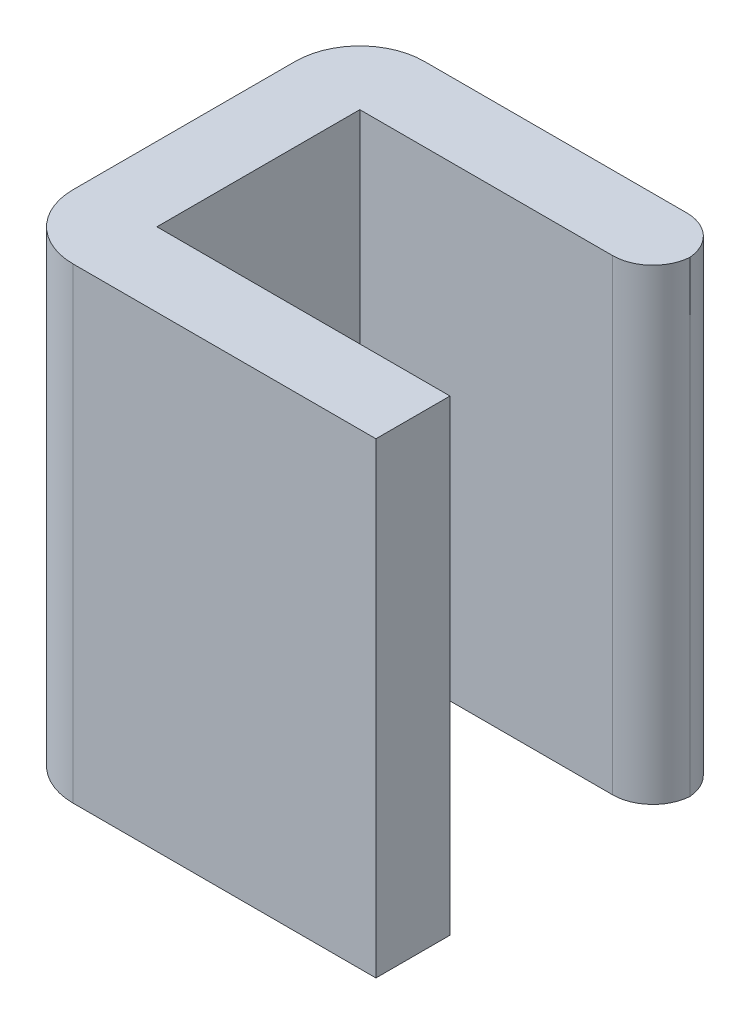
ISO-10303-21;
HEADER;
FILE_DESCRIPTION(('STEP AP214'),'2;1');
FILE_NAME('part.step','',(''),(''),'','','');
FILE_SCHEMA(('AUTOMOTIVE_DESIGN { 1 0 10303 214 1 1 1 1 }'));
ENDSEC;
DATA;
#1=APPLICATION_CONTEXT('core data for automotive mechanical design processes');
#2=APPLICATION_PROTOCOL_DEFINITION('international standard','automotive_design',2000,#1);
#3=PRODUCT_CONTEXT('',#1,'mechanical');
#4=PRODUCT('Part','Part','',(#3));
#5=PRODUCT_RELATED_PRODUCT_CATEGORY('part','',(#4));
#6=PRODUCT_DEFINITION_FORMATION('','',#4);
#7=PRODUCT_DEFINITION_CONTEXT('part definition',#1,'design');
#8=PRODUCT_DEFINITION('design','',#6,#7);
#9=PRODUCT_DEFINITION_SHAPE('','',#8);
#10=(LENGTH_UNIT() NAMED_UNIT(*) SI_UNIT(.MILLI.,.METRE.));
#11=(NAMED_UNIT(*) PLANE_ANGLE_UNIT() SI_UNIT($,.RADIAN.));
#12=(NAMED_UNIT(*) SI_UNIT($,.STERADIAN.) SOLID_ANGLE_UNIT());
#13=UNCERTAINTY_MEASURE_WITH_UNIT(LENGTH_MEASURE(1.E-05),#10,'distance_accuracy_value','');
#14=(GEOMETRIC_REPRESENTATION_CONTEXT(3) GLOBAL_UNCERTAINTY_ASSIGNED_CONTEXT((#13)) GLOBAL_UNIT_ASSIGNED_CONTEXT((#10,
#11,#12)) REPRESENTATION_CONTEXT('',''));
#15=CARTESIAN_POINT('',(0.,0.,0.));
#16=DIRECTION('',(0.,0.,1.));
#17=DIRECTION('',(1.,0.,0.));
#18=AXIS2_PLACEMENT_3D('',#15,#16,#17);
#19=CARTESIAN_POINT('',(-1.5825,-0.725,0.125));
#20=DIRECTION('',(0.,1.,0.));
#21=DIRECTION('',(0.,0.,1.));
#22=AXIS2_PLACEMENT_3D('',#19,#20,#21);
#23=CYLINDRICAL_SURFACE('',#22,0.125);
#24=CARTESIAN_POINT('',(-1.5825,-0.725,0.125));
#25=DIRECTION('',(0.,-1.,0.));
#26=DIRECTION('',(0.,0.,-1.));
#27=AXIS2_PLACEMENT_3D('',#24,#25,#26);
#28=CIRCLE('',#27,0.125);
#29=CARTESIAN_POINT('',(-1.5825,-0.725,0.));
#30=VERTEX_POINT('',#29);
#31=CARTESIAN_POINT('',(-1.45790064205623,-0.725,0.115));
#32=VERTEX_POINT('',#31);
#33=EDGE_CURVE('E203',#30,#32,#28,.T.);
#34=ORIENTED_EDGE('',*,*,#33,.F.);
#35=DIRECTION('',(0.,-1.,0.));
#36=VECTOR('',#35,1.);
#37=CARTESIAN_POINT('',(-1.5825,-0.725,0.));
#38=LINE('',#37,#36);
#39=CARTESIAN_POINT('',(-1.5825,0.725,0.));
#40=VERTEX_POINT('',#39);
#41=EDGE_CURVE('E21',#40,#30,#38,.T.);
#42=ORIENTED_EDGE('',*,*,#41,.F.);
#43=CARTESIAN_POINT('',(-1.5825,0.725,0.125));
#44=DIRECTION('',(0.,1.,0.));
#45=DIRECTION('',(0.,0.,-1.));
#46=AXIS2_PLACEMENT_3D('',#43,#44,#45);
#47=CIRCLE('',#46,0.125);
#48=CARTESIAN_POINT('',(-1.45790064205623,0.725,0.115));
#49=VERTEX_POINT('',#48);
#50=EDGE_CURVE('E182',#49,#40,#47,.T.);
#51=ORIENTED_EDGE('',*,*,#50,.F.);
#52=DIRECTION('',(0.,-1.,0.));
#53=VECTOR('',#52,1.);
#54=CARTESIAN_POINT('',(-1.45790064205623,0.,0.115));
#55=LINE('',#54,#53);
#56=EDGE_CURVE('E11',#49,#32,#55,.T.);
#57=ORIENTED_EDGE('',*,*,#56,.T.);
#58=EDGE_LOOP('',(#34,#42,#51,#57));
#59=FACE_BOUND('',#58,.T.);
#60=ADVANCED_FACE('F17',(#59),#23,.T.);
#61=CARTESIAN_POINT('',(-1.5825,-0.725,0.105));
#62=DIRECTION('',(0.,1.,0.));
#63=DIRECTION('',(0.,0.,1.));
#64=AXIS2_PLACEMENT_3D('',#61,#62,#63);
#65=CYLINDRICAL_SURFACE('',#64,0.125);
#66=DIRECTION('',(0.,1.,0.));
#67=VECTOR('',#66,1.);
#68=CARTESIAN_POINT('',(-1.5825,-0.725,0.23));
#69=LINE('',#68,#67);
#70=CARTESIAN_POINT('',(-1.5825,-0.725,0.23));
#71=VERTEX_POINT('',#70);
#72=CARTESIAN_POINT('',(-1.5825,0.725,0.23));
#73=VERTEX_POINT('',#72);
#74=EDGE_CURVE('E179',#71,#73,#69,.T.);
#75=ORIENTED_EDGE('',*,*,#74,.F.);
#76=CARTESIAN_POINT('',(-1.5825,-0.725,0.105));
#77=DIRECTION('',(0.,-1.,0.));
#78=DIRECTION('',(0.,0.,-1.));
#79=AXIS2_PLACEMENT_3D('',#76,#77,#78);
#80=CIRCLE('',#79,0.125);
#81=EDGE_CURVE('E200',#32,#71,#80,.T.);
#82=ORIENTED_EDGE('',*,*,#81,.F.);
#83=ORIENTED_EDGE('',*,*,#56,.F.);
#84=CARTESIAN_POINT('',(-1.5825,0.725,0.105));
#85=DIRECTION('',(0.,1.,0.));
#86=DIRECTION('',(0.,0.,-1.));
#87=AXIS2_PLACEMENT_3D('',#84,#85,#86);
#88=CIRCLE('',#87,0.125);
#89=EDGE_CURVE('E184',#73,#49,#88,.T.);
#90=ORIENTED_EDGE('',*,*,#89,.F.);
#91=EDGE_LOOP('',(#75,#82,#83,#90));
#92=FACE_BOUND('',#91,.T.);
#93=ADVANCED_FACE('F303',(#92),#65,.T.);
#94=CARTESIAN_POINT('',(-2.3975,-0.725,0.89));
#95=DIRECTION('',(0.,1.,0.));
#96=DIRECTION('',(0.,0.,1.));
#97=AXIS2_PLACEMENT_3D('',#94,#95,#96);
#98=CYLINDRICAL_SURFACE('',#97,0.2);
#99=CARTESIAN_POINT('',(-2.3975,-0.725,0.89));
#100=DIRECTION('',(0.,-1.,0.));
#101=DIRECTION('',(0.,0.,-1.));
#102=AXIS2_PLACEMENT_3D('',#99,#100,#101);
#103=CIRCLE('',#102,0.2);
#104=CARTESIAN_POINT('',(-2.3975,-0.725,1.09));
#105=VERTEX_POINT('',#104);
#106=CARTESIAN_POINT('',(-2.5975,-0.725,0.89));
#107=VERTEX_POINT('',#106);
#108=EDGE_CURVE('E112',#105,#107,#103,.T.);
#109=ORIENTED_EDGE('',*,*,#108,.F.);
#110=DIRECTION('',(0.,-1.,0.));
#111=VECTOR('',#110,1.);
#112=CARTESIAN_POINT('',(-2.3975,-0.725,1.09));
#113=LINE('',#112,#111);
#114=CARTESIAN_POINT('',(-2.3975,0.725,1.09));
#115=VERTEX_POINT('',#114);
#116=EDGE_CURVE('E143',#115,#105,#113,.T.);
#117=ORIENTED_EDGE('',*,*,#116,.F.);
#118=CARTESIAN_POINT('',(-2.3975,0.725,0.89));
#119=DIRECTION('',(0.,1.,0.));
#120=DIRECTION('',(0.,0.,-1.));
#121=AXIS2_PLACEMENT_3D('',#118,#119,#120);
#122=CIRCLE('',#121,0.2);
#123=CARTESIAN_POINT('',(-2.5975,0.725,0.89));
#124=VERTEX_POINT('',#123);
#125=EDGE_CURVE('E28',#124,#115,#122,.T.);
#126=ORIENTED_EDGE('',*,*,#125,.F.);
#127=DIRECTION('',(0.,1.,0.));
#128=VECTOR('',#127,1.);
#129=CARTESIAN_POINT('',(-2.5975,-0.725,0.89));
#130=LINE('',#129,#128);
#131=EDGE_CURVE('E247',#107,#124,#130,.T.);
#132=ORIENTED_EDGE('',*,*,#131,.F.);
#133=EDGE_LOOP('',(#109,#117,#126,#132));
#134=FACE_BOUND('',#133,.T.);
#135=ADVANCED_FACE('F301',(#134),#98,.T.);
#136=CARTESIAN_POINT('',(-2.3975,-0.725,0.2));
#137=DIRECTION('',(0.,1.,0.));
#138=DIRECTION('',(0.,0.,1.));
#139=AXIS2_PLACEMENT_3D('',#136,#137,#138);
#140=CYLINDRICAL_SURFACE('',#139,0.2);
#141=CARTESIAN_POINT('',(-2.3975,-0.725,0.2));
#142=DIRECTION('',(0.,-1.,0.));
#143=DIRECTION('',(0.,0.,-1.));
#144=AXIS2_PLACEMENT_3D('',#141,#142,#143);
#145=CIRCLE('',#144,0.2);
#146=CARTESIAN_POINT('',(-2.5975,-0.725,0.2));
#147=VERTEX_POINT('',#146);
#148=CARTESIAN_POINT('',(-2.3975,-0.725,0.));
#149=VERTEX_POINT('',#148);
#150=EDGE_CURVE('E189',#147,#149,#145,.T.);
#151=ORIENTED_EDGE('',*,*,#150,.F.);
#152=DIRECTION('',(0.,-1.,0.));
#153=VECTOR('',#152,1.);
#154=CARTESIAN_POINT('',(-2.5975,-0.725,0.2));
#155=LINE('',#154,#153);
#156=CARTESIAN_POINT('',(-2.5975,0.725,0.2));
#157=VERTEX_POINT('',#156);
#158=EDGE_CURVE('E170',#157,#147,#155,.T.);
#159=ORIENTED_EDGE('',*,*,#158,.F.);
#160=CARTESIAN_POINT('',(-2.3975,0.725,0.2));
#161=DIRECTION('',(0.,1.,0.));
#162=DIRECTION('',(0.,0.,-1.));
#163=AXIS2_PLACEMENT_3D('',#160,#161,#162);
#164=CIRCLE('',#163,0.2);
#165=CARTESIAN_POINT('',(-2.3975,0.725,0.));
#166=VERTEX_POINT('',#165);
#167=EDGE_CURVE('E103',#166,#157,#164,.T.);
#168=ORIENTED_EDGE('',*,*,#167,.F.);
#169=DIRECTION('',(0.,1.,0.));
#170=VECTOR('',#169,1.);
#171=CARTESIAN_POINT('',(-2.3975,-0.725,0.));
#172=LINE('',#171,#170);
#173=EDGE_CURVE('E252',#149,#166,#172,.T.);
#174=ORIENTED_EDGE('',*,*,#173,.F.);
#175=EDGE_LOOP('',(#151,#159,#168,#174));
#176=FACE_BOUND('',#175,.T.);
#177=ADVANCED_FACE('F297',(#176),#140,.T.);
#178=CARTESIAN_POINT('',(-2.0275,0.725,0.545));
#179=DIRECTION('',(0.,-1.,0.));
#180=DIRECTION('',(0.,0.,-1.));
#181=AXIS2_PLACEMENT_3D('',#178,#179,#180);
#182=PLANE('',#181);
#183=ORIENTED_EDGE('',*,*,#89,.T.);
#184=ORIENTED_EDGE('',*,*,#50,.T.);
#185=DIRECTION('',(-1.,0.,0.));
#186=VECTOR('',#185,1.);
#187=CARTESIAN_POINT('',(-2.0275,0.725,0.));
#188=LINE('',#187,#186);
#189=EDGE_CURVE('E259',#40,#166,#188,.T.);
#190=ORIENTED_EDGE('',*,*,#189,.T.);
#191=ORIENTED_EDGE('',*,*,#167,.T.);
#192=DIRECTION('',(0.,0.,1.));
#193=VECTOR('',#192,1.);
#194=CARTESIAN_POINT('',(-2.5975,0.725,0.545));
#195=LINE('',#194,#193);
#196=EDGE_CURVE('E174',#157,#124,#195,.T.);
#197=ORIENTED_EDGE('',*,*,#196,.T.);
#198=ORIENTED_EDGE('',*,*,#125,.T.);
#199=DIRECTION('',(1.,0.,0.));
#200=VECTOR('',#199,1.);
#201=CARTESIAN_POINT('',(-2.0275,0.725,1.09));
#202=LINE('',#201,#200);
#203=CARTESIAN_POINT('',(-1.4575,0.725,1.09));
#204=VERTEX_POINT('',#203);
#205=EDGE_CURVE('E133',#115,#204,#202,.T.);
#206=ORIENTED_EDGE('',*,*,#205,.T.);
#207=DIRECTION('',(0.,0.,-1.));
#208=VECTOR('',#207,1.);
#209=CARTESIAN_POINT('',(-1.4575,0.725,0.975));
#210=LINE('',#209,#208);
#211=CARTESIAN_POINT('',(-1.4575,0.725,0.86));
#212=VERTEX_POINT('',#211);
#213=EDGE_CURVE('E138',#204,#212,#210,.T.);
#214=ORIENTED_EDGE('',*,*,#213,.T.);
#215=DIRECTION('',(-1.,0.,0.));
#216=VECTOR('',#215,1.);
#217=CARTESIAN_POINT('',(-1.9125,0.725,0.86));
#218=LINE('',#217,#216);
#219=CARTESIAN_POINT('',(-2.3675,0.725,0.86));
#220=VERTEX_POINT('',#219);
#221=EDGE_CURVE('E216',#212,#220,#218,.T.);
#222=ORIENTED_EDGE('',*,*,#221,.T.);
#223=DIRECTION('',(0.,0.,-1.));
#224=VECTOR('',#223,1.);
#225=CARTESIAN_POINT('',(-2.3675,0.725,0.545));
#226=LINE('',#225,#224);
#227=CARTESIAN_POINT('',(-2.3675,0.725,0.23));
#228=VERTEX_POINT('',#227);
#229=EDGE_CURVE('E206',#220,#228,#226,.T.);
#230=ORIENTED_EDGE('',*,*,#229,.T.);
#231=DIRECTION('',(1.,0.,0.));
#232=VECTOR('',#231,1.);
#233=CARTESIAN_POINT('',(-1.9125,0.725,0.23));
#234=LINE('',#233,#232);
#235=EDGE_CURVE('E175',#228,#73,#234,.T.);
#236=ORIENTED_EDGE('',*,*,#235,.T.);
#237=EDGE_LOOP('',(#183,#184,#190,#191,#197,#198,#206,#214,#222,#230,#236));
#238=FACE_BOUND('',#237,.T.);
#239=ADVANCED_FACE('F136',(#238),#182,.F.);
#240=CARTESIAN_POINT('',(-2.0275,-0.725,0.545));
#241=DIRECTION('',(0.,-1.,0.));
#242=DIRECTION('',(0.,0.,-1.));
#243=AXIS2_PLACEMENT_3D('',#240,#241,#242);
#244=PLANE('',#243);
#245=DIRECTION('',(-1.,0.,0.));
#246=VECTOR('',#245,1.);
#247=CARTESIAN_POINT('',(-2.0275,-0.725,0.));
#248=LINE('',#247,#246);
#249=EDGE_CURVE('E168',#30,#149,#248,.T.);
#250=ORIENTED_EDGE('',*,*,#249,.F.);
#251=ORIENTED_EDGE('',*,*,#33,.T.);
#252=ORIENTED_EDGE('',*,*,#81,.T.);
#253=DIRECTION('',(1.,0.,0.));
#254=VECTOR('',#253,1.);
#255=CARTESIAN_POINT('',(-1.9125,-0.725,0.23));
#256=LINE('',#255,#254);
#257=CARTESIAN_POINT('',(-2.3675,-0.725,0.23));
#258=VERTEX_POINT('',#257);
#259=EDGE_CURVE('E244',#258,#71,#256,.T.);
#260=ORIENTED_EDGE('',*,*,#259,.F.);
#261=DIRECTION('',(0.,0.,-1.));
#262=VECTOR('',#261,1.);
#263=CARTESIAN_POINT('',(-2.3675,-0.725,0.545));
#264=LINE('',#263,#262);
#265=CARTESIAN_POINT('',(-2.3675,-0.725,0.86));
#266=VERTEX_POINT('',#265);
#267=EDGE_CURVE('E213',#266,#258,#264,.T.);
#268=ORIENTED_EDGE('',*,*,#267,.F.);
#269=DIRECTION('',(-1.,0.,0.));
#270=VECTOR('',#269,1.);
#271=CARTESIAN_POINT('',(-1.9125,-0.725,0.86));
#272=LINE('',#271,#270);
#273=CARTESIAN_POINT('',(-1.4575,-0.725,0.86));
#274=VERTEX_POINT('',#273);
#275=EDGE_CURVE('E159',#274,#266,#272,.T.);
#276=ORIENTED_EDGE('',*,*,#275,.F.);
#277=DIRECTION('',(0.,0.,-1.));
#278=VECTOR('',#277,1.);
#279=CARTESIAN_POINT('',(-1.4575,-0.725,0.975));
#280=LINE('',#279,#278);
#281=CARTESIAN_POINT('',(-1.4575,-0.725,1.09));
#282=VERTEX_POINT('',#281);
#283=EDGE_CURVE('E144',#282,#274,#280,.T.);
#284=ORIENTED_EDGE('',*,*,#283,.F.);
#285=DIRECTION('',(1.,0.,0.));
#286=VECTOR('',#285,1.);
#287=CARTESIAN_POINT('',(-2.0275,-0.725,1.09));
#288=LINE('',#287,#286);
#289=EDGE_CURVE('E149',#105,#282,#288,.T.);
#290=ORIENTED_EDGE('',*,*,#289,.F.);
#291=ORIENTED_EDGE('',*,*,#108,.T.);
#292=DIRECTION('',(0.,0.,1.));
#293=VECTOR('',#292,1.);
#294=CARTESIAN_POINT('',(-2.5975,-0.725,0.545));
#295=LINE('',#294,#293);
#296=EDGE_CURVE('E173',#147,#107,#295,.T.);
#297=ORIENTED_EDGE('',*,*,#296,.F.);
#298=ORIENTED_EDGE('',*,*,#150,.T.);
#299=EDGE_LOOP('',(#250,#251,#252,#260,#268,#276,#284,#290,#291,#297,#298));
#300=FACE_BOUND('',#299,.T.);
#301=ADVANCED_FACE('F293',(#300),#244,.T.);
#302=CARTESIAN_POINT('',(-2.5975,-0.725,0.545));
#303=DIRECTION('',(-1.,0.,0.));
#304=DIRECTION('',(0.,0.,1.));
#305=AXIS2_PLACEMENT_3D('',#302,#303,#304);
#306=PLANE('',#305);
#307=ORIENTED_EDGE('',*,*,#196,.F.);
#308=ORIENTED_EDGE('',*,*,#158,.T.);
#309=ORIENTED_EDGE('',*,*,#296,.T.);
#310=ORIENTED_EDGE('',*,*,#131,.T.);
#311=EDGE_LOOP('',(#307,#308,#309,#310));
#312=FACE_BOUND('',#311,.T.);
#313=ADVANCED_FACE('F300',(#312),#306,.T.);
#314=CARTESIAN_POINT('',(-2.0275,-0.725,1.09));
#315=DIRECTION('',(0.,0.,1.));
#316=DIRECTION('',(1.,0.,0.));
#317=AXIS2_PLACEMENT_3D('',#314,#315,#316);
#318=PLANE('',#317);
#319=ORIENTED_EDGE('',*,*,#205,.F.);
#320=ORIENTED_EDGE('',*,*,#116,.T.);
#321=ORIENTED_EDGE('',*,*,#289,.T.);
#322=DIRECTION('',(0.,1.,0.));
#323=VECTOR('',#322,1.);
#324=CARTESIAN_POINT('',(-1.4575,-0.725,1.09));
#325=LINE('',#324,#323);
#326=EDGE_CURVE('E147',#282,#204,#325,.T.);
#327=ORIENTED_EDGE('',*,*,#326,.T.);
#328=EDGE_LOOP('',(#319,#320,#321,#327));
#329=FACE_BOUND('',#328,.T.);
#330=ADVANCED_FACE('F148',(#329),#318,.T.);
#331=CARTESIAN_POINT('',(-1.4575,-0.725,0.975));
#332=DIRECTION('',(1.,0.,0.));
#333=DIRECTION('',(0.,1.,0.));
#334=AXIS2_PLACEMENT_3D('',#331,#332,#333);
#335=PLANE('',#334);
#336=DIRECTION('',(0.,1.,0.));
#337=VECTOR('',#336,1.);
#338=CARTESIAN_POINT('',(-1.4575,-0.725,0.86));
#339=LINE('',#338,#337);
#340=EDGE_CURVE('E156',#274,#212,#339,.T.);
#341=ORIENTED_EDGE('',*,*,#340,.T.);
#342=ORIENTED_EDGE('',*,*,#213,.F.);
#343=ORIENTED_EDGE('',*,*,#326,.F.);
#344=ORIENTED_EDGE('',*,*,#283,.T.);
#345=EDGE_LOOP('',(#341,#342,#343,#344));
#346=FACE_BOUND('',#345,.T.);
#347=ADVANCED_FACE('F154',(#346),#335,.T.);
#348=CARTESIAN_POINT('',(-1.9125,-0.725,0.86));
#349=DIRECTION('',(0.,0.,-1.));
#350=DIRECTION('',(0.,-1.,0.));
#351=AXIS2_PLACEMENT_3D('',#348,#349,#350);
#352=PLANE('',#351);
#353=DIRECTION('',(0.,1.,0.));
#354=VECTOR('',#353,1.);
#355=CARTESIAN_POINT('',(-2.3675,-0.725,0.86));
#356=LINE('',#355,#354);
#357=EDGE_CURVE('E195',#266,#220,#356,.T.);
#358=ORIENTED_EDGE('',*,*,#357,.T.);
#359=ORIENTED_EDGE('',*,*,#221,.F.);
#360=ORIENTED_EDGE('',*,*,#340,.F.);
#361=ORIENTED_EDGE('',*,*,#275,.T.);
#362=EDGE_LOOP('',(#358,#359,#360,#361));
#363=FACE_BOUND('',#362,.T.);
#364=ADVANCED_FACE('F19',(#363),#352,.T.);
#365=CARTESIAN_POINT('',(-2.3675,-0.725,0.545));
#366=DIRECTION('',(1.,0.,0.));
#367=DIRECTION('',(0.,1.,0.));
#368=AXIS2_PLACEMENT_3D('',#365,#366,#367);
#369=PLANE('',#368);
#370=DIRECTION('',(0.,1.,0.));
#371=VECTOR('',#370,1.);
#372=CARTESIAN_POINT('',(-2.3675,-0.725,0.23));
#373=LINE('',#372,#371);
#374=EDGE_CURVE('E178',#258,#228,#373,.T.);
#375=ORIENTED_EDGE('',*,*,#374,.T.);
#376=ORIENTED_EDGE('',*,*,#229,.F.);
#377=ORIENTED_EDGE('',*,*,#357,.F.);
#378=ORIENTED_EDGE('',*,*,#267,.T.);
#379=EDGE_LOOP('',(#375,#376,#377,#378));
#380=FACE_BOUND('',#379,.T.);
#381=ADVANCED_FACE('F224',(#380),#369,.T.);
#382=CARTESIAN_POINT('',(-1.9125,-0.725,0.23));
#383=DIRECTION('',(0.,0.,1.));
#384=DIRECTION('',(1.,0.,0.));
#385=AXIS2_PLACEMENT_3D('',#382,#383,#384);
#386=PLANE('',#385);
#387=ORIENTED_EDGE('',*,*,#259,.T.);
#388=ORIENTED_EDGE('',*,*,#74,.T.);
#389=ORIENTED_EDGE('',*,*,#235,.F.);
#390=ORIENTED_EDGE('',*,*,#374,.F.);
#391=EDGE_LOOP('',(#387,#388,#389,#390));
#392=FACE_BOUND('',#391,.T.);
#393=ADVANCED_FACE('F231',(#392),#386,.T.);
#394=CARTESIAN_POINT('',(-2.0275,-0.725,0.));
#395=DIRECTION('',(0.,0.,-1.));
#396=DIRECTION('',(0.,-1.,0.));
#397=AXIS2_PLACEMENT_3D('',#394,#395,#396);
#398=PLANE('',#397);
#399=ORIENTED_EDGE('',*,*,#189,.F.);
#400=ORIENTED_EDGE('',*,*,#41,.T.);
#401=ORIENTED_EDGE('',*,*,#249,.T.);
#402=ORIENTED_EDGE('',*,*,#173,.T.);
#403=EDGE_LOOP('',(#399,#400,#401,#402));
#404=FACE_BOUND('',#403,.T.);
#405=ADVANCED_FACE('F290',(#404),#398,.T.);
#406=CLOSED_SHELL('',(#60,#93,#135,#177,#239,#301,#313,#330,#347,#364,#381,#393,#405));
#407=MANIFOLD_SOLID_BREP('B1',#406);
#408=ADVANCED_BREP_SHAPE_REPRESENTATION('',(#18,#407),#14);
#409=SHAPE_DEFINITION_REPRESENTATION(#9,#408);
ENDSEC;
END-ISO-10303-21;
